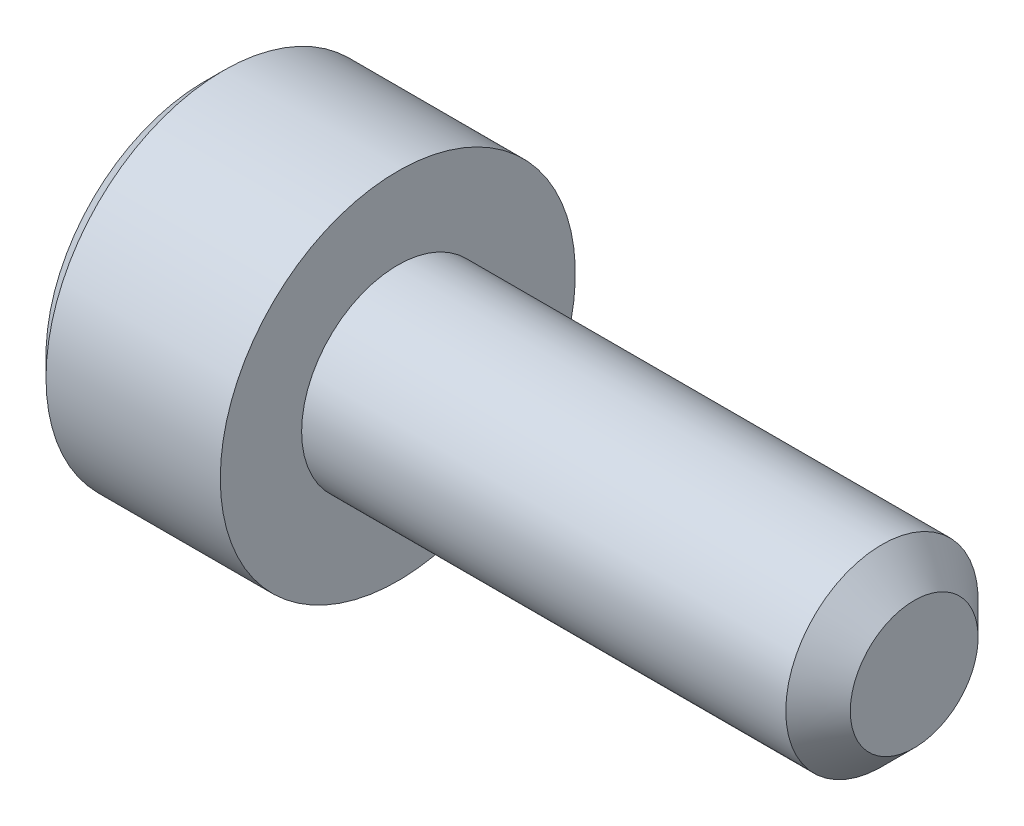
ISO-10303-21;
HEADER;
FILE_DESCRIPTION(('STEP AP214'),'2;1');
FILE_NAME('part.step','',(''),(''),'','','');
FILE_SCHEMA(('AUTOMOTIVE_DESIGN { 1 0 10303 214 1 1 1 1 }'));
ENDSEC;
DATA;
#1=APPLICATION_CONTEXT('core data for automotive mechanical design processes');
#2=APPLICATION_PROTOCOL_DEFINITION('international standard','automotive_design',2000,#1);
#3=PRODUCT_CONTEXT('',#1,'mechanical');
#4=PRODUCT('Part','Part','',(#3));
#5=PRODUCT_RELATED_PRODUCT_CATEGORY('part','',(#4));
#6=PRODUCT_DEFINITION_FORMATION('','',#4);
#7=PRODUCT_DEFINITION_CONTEXT('part definition',#1,'design');
#8=PRODUCT_DEFINITION('design','',#6,#7);
#9=PRODUCT_DEFINITION_SHAPE('','',#8);
#10=(LENGTH_UNIT() NAMED_UNIT(*) SI_UNIT(.MILLI.,.METRE.));
#11=(NAMED_UNIT(*) PLANE_ANGLE_UNIT() SI_UNIT($,.RADIAN.));
#12=(NAMED_UNIT(*) SI_UNIT($,.STERADIAN.) SOLID_ANGLE_UNIT());
#13=UNCERTAINTY_MEASURE_WITH_UNIT(LENGTH_MEASURE(1.E-05),#10,'distance_accuracy_value','');
#14=(GEOMETRIC_REPRESENTATION_CONTEXT(3) GLOBAL_UNCERTAINTY_ASSIGNED_CONTEXT((#13)) GLOBAL_UNIT_ASSIGNED_CONTEXT((#10,
#11,#12)) REPRESENTATION_CONTEXT('',''));
#15=CARTESIAN_POINT('',(0.,0.,0.));
#16=DIRECTION('',(0.,0.,1.));
#17=DIRECTION('',(1.,0.,0.));
#18=AXIS2_PLACEMENT_3D('',#15,#16,#17);
#19=CARTESIAN_POINT('',(0.,0.,0.));
#20=DIRECTION('',(1.,0.,0.));
#21=DIRECTION('',(0.,0.,-1.));
#22=AXIS2_PLACEMENT_3D('',#19,#20,#21);
#23=PLANE('',#22);
#24=DIRECTION('',(0.,0.866025403784439,0.5));
#25=VECTOR('',#24,1.);
#26=CARTESIAN_POINT('',(0.,1.4,-0.981495457622362));
#27=LINE('',#26,#25);
#28=CARTESIAN_POINT('',(0.,0.,-1.78978583448784));
#29=VERTEX_POINT('',#28);
#30=CARTESIAN_POINT('',(0.,1.55,-0.894892917243918));
#31=VERTEX_POINT('',#30);
#32=EDGE_CURVE('E158',#29,#31,#27,.T.);
#33=ORIENTED_EDGE('',*,*,#32,.T.);
#34=DIRECTION('',(0.,0.,1.));
#35=VECTOR('',#34,1.);
#36=CARTESIAN_POINT('',(0.,1.55,0.721687836487032));
#37=LINE('',#36,#35);
#38=CARTESIAN_POINT('',(0.,1.55,0.894892917243919));
#39=VERTEX_POINT('',#38);
#40=EDGE_CURVE('E168',#31,#39,#37,.T.);
#41=ORIENTED_EDGE('',*,*,#40,.T.);
#42=DIRECTION('',(0.,-0.866025403784439,0.5));
#43=VECTOR('',#42,1.);
#44=CARTESIAN_POINT('',(0.,0.15,1.7031832941094));
#45=LINE('',#44,#43);
#46=CARTESIAN_POINT('',(0.,0.,1.78978583448784));
#47=VERTEX_POINT('',#46);
#48=EDGE_CURVE('E166',#39,#47,#45,.T.);
#49=ORIENTED_EDGE('',*,*,#48,.T.);
#50=DIRECTION('',(0.,-0.866025403784439,-0.5));
#51=VECTOR('',#50,1.);
#52=CARTESIAN_POINT('',(0.,-1.4,0.981495457622364));
#53=LINE('',#52,#51);
#54=CARTESIAN_POINT('',(0.,-1.55,0.89489291724392));
#55=VERTEX_POINT('',#54);
#56=EDGE_CURVE('E164',#47,#55,#53,.T.);
#57=ORIENTED_EDGE('',*,*,#56,.T.);
#58=DIRECTION('',(0.,0.,-1.));
#59=VECTOR('',#58,1.);
#60=CARTESIAN_POINT('',(0.,-1.55,-0.721687836487031));
#61=LINE('',#60,#59);
#62=CARTESIAN_POINT('',(0.,-1.55,-0.894892917243919));
#63=VERTEX_POINT('',#62);
#64=EDGE_CURVE('E162',#55,#63,#61,.T.);
#65=ORIENTED_EDGE('',*,*,#64,.T.);
#66=DIRECTION('',(0.,0.866025403784439,-0.5));
#67=VECTOR('',#66,1.);
#68=CARTESIAN_POINT('',(0.,-0.149999999999999,-1.7031832941094));
#69=LINE('',#68,#67);
#70=EDGE_CURVE('E160',#63,#29,#69,.T.);
#71=ORIENTED_EDGE('',*,*,#70,.T.);
#72=EDGE_LOOP('',(#33,#41,#49,#57,#65,#71));
#73=FACE_BOUND('',#72,.T.);
#74=CARTESIAN_POINT('',(0.,0.,0.));
#75=DIRECTION('',(1.,0.,0.));
#76=DIRECTION('',(0.,0.,-1.));
#77=AXIS2_PLACEMENT_3D('',#74,#75,#76);
#78=CIRCLE('',#77,2.44999999999999);
#79=CARTESIAN_POINT('',(0.,0.,-2.44999999999999));
#80=VERTEX_POINT('',#79);
#81=EDGE_CURVE('E152',#80,#80,#78,.F.);
#82=ORIENTED_EDGE('',*,*,#81,.T.);
#83=EDGE_LOOP('',(#82));
#84=FACE_BOUND('',#83,.T.);
#85=ADVANCED_FACE('F37',(#73,#84),#23,.F.);
#86=CARTESIAN_POINT('',(11.,0.,0.));
#87=DIRECTION('',(-1.,0.,0.));
#88=DIRECTION('',(0.,0.,1.));
#89=AXIS2_PLACEMENT_3D('',#86,#87,#88);
#90=PLANE('',#89);
#91=CARTESIAN_POINT('',(11.,0.,0.));
#92=DIRECTION('',(-1.,0.,0.));
#93=DIRECTION('',(0.,0.,1.));
#94=AXIS2_PLACEMENT_3D('',#91,#92,#93);
#95=CIRCLE('',#94,0.989999999999991);
#96=CARTESIAN_POINT('',(11.,0.,0.989999999999991));
#97=VERTEX_POINT('',#96);
#98=EDGE_CURVE('E149',#97,#97,#95,.F.);
#99=ORIENTED_EDGE('',*,*,#98,.T.);
#100=EDGE_LOOP('',(#99));
#101=FACE_BOUND('',#100,.T.);
#102=ADVANCED_FACE('F248',(#101),#90,.F.);
#103=CARTESIAN_POINT('',(-88.7054908485857,0.,0.));
#104=DIRECTION('',(-1.,0.,0.));
#105=DIRECTION('',(0.,0.,1.));
#106=AXIS2_PLACEMENT_3D('',#103,#104,#105);
#107=CYLINDRICAL_SURFACE('',#106,1.49);
#108=CARTESIAN_POINT('',(10.5,0.,0.));
#109=DIRECTION('',(-1.,0.,0.));
#110=DIRECTION('',(0.,0.,1.));
#111=AXIS2_PLACEMENT_3D('',#108,#109,#110);
#112=CIRCLE('',#111,1.49);
#113=CARTESIAN_POINT('',(10.5,0.,1.49));
#114=VERTEX_POINT('',#113);
#115=EDGE_CURVE('E146',#114,#114,#112,.T.);
#116=ORIENTED_EDGE('',*,*,#115,.T.);
#117=EDGE_LOOP('',(#116));
#118=FACE_BOUND('',#117,.T.);
#119=CARTESIAN_POINT('',(3.,0.,0.));
#120=DIRECTION('',(-1.,0.,0.));
#121=DIRECTION('',(0.,0.,1.));
#122=AXIS2_PLACEMENT_3D('',#119,#120,#121);
#123=CIRCLE('',#122,1.49);
#124=CARTESIAN_POINT('',(3.,0.,1.49));
#125=VERTEX_POINT('',#124);
#126=EDGE_CURVE('E138',#125,#125,#123,.T.);
#127=ORIENTED_EDGE('',*,*,#126,.F.);
#128=EDGE_LOOP('',(#127));
#129=FACE_BOUND('',#128,.T.);
#130=ADVANCED_FACE('F253',(#118,#129),#107,.T.);
#131=CARTESIAN_POINT('',(3.,1.49,0.));
#132=DIRECTION('',(-1.,0.,0.));
#133=DIRECTION('',(0.,0.,1.));
#134=AXIS2_PLACEMENT_3D('',#131,#132,#133);
#135=PLANE('',#134);
#136=CARTESIAN_POINT('',(3.,0.,0.));
#137=DIRECTION('',(-1.,0.,0.));
#138=DIRECTION('',(0.,0.,1.));
#139=AXIS2_PLACEMENT_3D('',#136,#137,#138);
#140=CIRCLE('',#139,2.75);
#141=CARTESIAN_POINT('',(3.,0.,2.75));
#142=VERTEX_POINT('',#141);
#143=EDGE_CURVE('E134',#142,#142,#140,.T.);
#144=ORIENTED_EDGE('',*,*,#143,.F.);
#145=EDGE_LOOP('',(#144));
#146=FACE_BOUND('',#145,.T.);
#147=ORIENTED_EDGE('',*,*,#126,.T.);
#148=EDGE_LOOP('',(#147));
#149=FACE_BOUND('',#148,.T.);
#150=ADVANCED_FACE('F263',(#146,#149),#135,.F.);
#151=CARTESIAN_POINT('',(-88.7054908485857,0.,0.));
#152=DIRECTION('',(-1.,0.,0.));
#153=DIRECTION('',(0.,0.,1.));
#154=AXIS2_PLACEMENT_3D('',#151,#152,#153);
#155=CYLINDRICAL_SURFACE('',#154,2.75);
#156=CARTESIAN_POINT('',(0.300000000000009,0.,0.));
#157=DIRECTION('',(1.,0.,0.));
#158=DIRECTION('',(0.,0.,-1.));
#159=AXIS2_PLACEMENT_3D('',#156,#157,#158);
#160=CIRCLE('',#159,2.75);
#161=CARTESIAN_POINT('',(0.300000000000009,0.,-2.75));
#162=VERTEX_POINT('',#161);
#163=EDGE_CURVE('E155',#162,#162,#160,.T.);
#164=ORIENTED_EDGE('',*,*,#163,.T.);
#165=EDGE_LOOP('',(#164));
#166=FACE_BOUND('',#165,.T.);
#167=ORIENTED_EDGE('',*,*,#143,.T.);
#168=EDGE_LOOP('',(#167));
#169=FACE_BOUND('',#168,.T.);
#170=ADVANCED_FACE('F259',(#166,#169),#155,.T.);
#171=CARTESIAN_POINT('',(10.5,0.,0.));
#172=DIRECTION('',(-1.,0.,0.));
#173=DIRECTION('',(0.,0.,1.));
#174=AXIS2_PLACEMENT_3D('',#171,#172,#173);
#175=CONICAL_SURFACE('',#174,1.49,0.785398163397451);
#176=ORIENTED_EDGE('',*,*,#98,.F.);
#177=EDGE_LOOP('',(#176));
#178=FACE_BOUND('',#177,.T.);
#179=ORIENTED_EDGE('',*,*,#115,.F.);
#180=EDGE_LOOP('',(#179));
#181=FACE_BOUND('',#180,.T.);
#182=ADVANCED_FACE('F262',(#178,#181),#175,.T.);
#183=CARTESIAN_POINT('',(0.,0.,0.));
#184=DIRECTION('',(1.,0.,0.));
#185=DIRECTION('',(0.,0.,-1.));
#186=AXIS2_PLACEMENT_3D('',#183,#184,#185);
#187=CONICAL_SURFACE('',#186,2.44999999999999,0.785398163397444);
#188=ORIENTED_EDGE('',*,*,#163,.F.);
#189=EDGE_LOOP('',(#188));
#190=FACE_BOUND('',#189,.T.);
#191=ORIENTED_EDGE('',*,*,#81,.F.);
#192=EDGE_LOOP('',(#191));
#193=FACE_BOUND('',#192,.T.);
#194=ADVANCED_FACE('F273',(#190,#193),#187,.T.);
#195=CARTESIAN_POINT('',(2.5,1.25,0.721687836487032));
#196=DIRECTION('',(0.,-0.5,-0.866025403784438));
#197=DIRECTION('',(0.,0.866025403784439,-0.5));
#198=AXIS2_PLACEMENT_3D('',#195,#196,#197);
#199=PLANE('',#198);
#200=DIRECTION('',(-1.,0.,0.));
#201=VECTOR('',#200,1.);
#202=CARTESIAN_POINT('',(2.5,0.,1.44337567297407));
#203=LINE('',#202,#201);
#204=CARTESIAN_POINT('',(2.5,0.,1.44337567297407));
#205=VERTEX_POINT('',#204);
#206=CARTESIAN_POINT('',(0.3,0.,1.44337567297407));
#207=VERTEX_POINT('',#206);
#208=EDGE_CURVE('E126',#205,#207,#203,.T.);
#209=ORIENTED_EDGE('',*,*,#208,.T.);
#210=DIRECTION('',(0.,0.866025403784439,-0.5));
#211=VECTOR('',#210,1.);
#212=CARTESIAN_POINT('',(0.3,1.25,0.721687836487032));
#213=LINE('',#212,#211);
#214=CARTESIAN_POINT('',(0.3,1.25,0.721687836487032));
#215=VERTEX_POINT('',#214);
#216=EDGE_CURVE('E174',#207,#215,#213,.T.);
#217=ORIENTED_EDGE('',*,*,#216,.T.);
#218=DIRECTION('',(-1.,0.,0.));
#219=VECTOR('',#218,1.);
#220=CARTESIAN_POINT('',(2.5,1.25,0.721687836487032));
#221=LINE('',#220,#219);
#222=CARTESIAN_POINT('',(2.5,1.25,0.721687836487032));
#223=VERTEX_POINT('',#222);
#224=EDGE_CURVE('E129',#223,#215,#221,.T.);
#225=ORIENTED_EDGE('',*,*,#224,.F.);
#226=DIRECTION('',(0.,-0.866025403784439,0.5));
#227=VECTOR('',#226,1.);
#228=CARTESIAN_POINT('',(2.5,1.25,0.721687836487032));
#229=LINE('',#228,#227);
#230=EDGE_CURVE('E114',#223,#205,#229,.T.);
#231=ORIENTED_EDGE('',*,*,#230,.T.);
#232=EDGE_LOOP('',(#209,#217,#225,#231));
#233=FACE_BOUND('',#232,.T.);
#234=ADVANCED_FACE('F125',(#233),#199,.T.);
#235=CARTESIAN_POINT('',(2.5,0.,1.44337567297407));
#236=DIRECTION('',(0.,0.5,-0.866025403784438));
#237=DIRECTION('',(0.,0.866025403784439,0.5));
#238=AXIS2_PLACEMENT_3D('',#235,#236,#237);
#239=PLANE('',#238);
#240=DIRECTION('',(-1.,0.,0.));
#241=VECTOR('',#240,1.);
#242=CARTESIAN_POINT('',(2.5,-1.25,0.721687836487033));
#243=LINE('',#242,#241);
#244=CARTESIAN_POINT('',(2.5,-1.25,0.721687836487033));
#245=VERTEX_POINT('',#244);
#246=CARTESIAN_POINT('',(0.3,-1.25,0.721687836487033));
#247=VERTEX_POINT('',#246);
#248=EDGE_CURVE('E135',#245,#247,#243,.T.);
#249=ORIENTED_EDGE('',*,*,#248,.T.);
#250=DIRECTION('',(0.,0.866025403784439,0.5));
#251=VECTOR('',#250,1.);
#252=CARTESIAN_POINT('',(0.3,0.,1.44337567297407));
#253=LINE('',#252,#251);
#254=EDGE_CURVE('E133',#247,#207,#253,.T.);
#255=ORIENTED_EDGE('',*,*,#254,.T.);
#256=ORIENTED_EDGE('',*,*,#208,.F.);
#257=DIRECTION('',(0.,-0.866025403784439,-0.5));
#258=VECTOR('',#257,1.);
#259=CARTESIAN_POINT('',(2.5,0.,1.44337567297407));
#260=LINE('',#259,#258);
#261=EDGE_CURVE('E110',#205,#245,#260,.T.);
#262=ORIENTED_EDGE('',*,*,#261,.T.);
#263=EDGE_LOOP('',(#249,#255,#256,#262));
#264=FACE_BOUND('',#263,.T.);
#265=ADVANCED_FACE('F131',(#264),#239,.T.);
#266=CARTESIAN_POINT('',(2.5,-1.25,0.721687836487033));
#267=DIRECTION('',(0.,1.,0.));
#268=DIRECTION('',(0.,0.,1.));
#269=AXIS2_PLACEMENT_3D('',#266,#267,#268);
#270=PLANE('',#269);
#271=DIRECTION('',(-1.,0.,0.));
#272=VECTOR('',#271,1.);
#273=CARTESIAN_POINT('',(2.5,-1.25,-0.721687836487031));
#274=LINE('',#273,#272);
#275=CARTESIAN_POINT('',(2.5,-1.25,-0.721687836487031));
#276=VERTEX_POINT('',#275);
#277=CARTESIAN_POINT('',(0.3,-1.25,-0.721687836487031));
#278=VERTEX_POINT('',#277);
#279=EDGE_CURVE('E140',#276,#278,#274,.T.);
#280=ORIENTED_EDGE('',*,*,#279,.T.);
#281=DIRECTION('',(0.,0.,1.));
#282=VECTOR('',#281,1.);
#283=CARTESIAN_POINT('',(0.3,-1.25,0.721687836487033));
#284=LINE('',#283,#282);
#285=EDGE_CURVE('E177',#278,#247,#284,.T.);
#286=ORIENTED_EDGE('',*,*,#285,.T.);
#287=ORIENTED_EDGE('',*,*,#248,.F.);
#288=DIRECTION('',(0.,0.,-1.));
#289=VECTOR('',#288,1.);
#290=CARTESIAN_POINT('',(2.5,-1.25,0.721687836487033));
#291=LINE('',#290,#289);
#292=EDGE_CURVE('E116',#245,#276,#291,.T.);
#293=ORIENTED_EDGE('',*,*,#292,.T.);
#294=EDGE_LOOP('',(#280,#286,#287,#293));
#295=FACE_BOUND('',#294,.T.);
#296=ADVANCED_FACE('F204',(#295),#270,.T.);
#297=CARTESIAN_POINT('',(2.5,-1.25,-0.721687836487031));
#298=DIRECTION('',(0.,0.5,0.866025403784439));
#299=DIRECTION('',(0.,-0.866025403784439,0.5));
#300=AXIS2_PLACEMENT_3D('',#297,#298,#299);
#301=PLANE('',#300);
#302=DIRECTION('',(-1.,0.,0.));
#303=VECTOR('',#302,1.);
#304=CARTESIAN_POINT('',(2.5,0.,-1.44337567297406));
#305=LINE('',#304,#303);
#306=CARTESIAN_POINT('',(2.5,0.,-1.44337567297406));
#307=VERTEX_POINT('',#306);
#308=CARTESIAN_POINT('',(0.3,0.,-1.44337567297406));
#309=VERTEX_POINT('',#308);
#310=EDGE_CURVE('E205',#307,#309,#305,.T.);
#311=ORIENTED_EDGE('',*,*,#310,.T.);
#312=DIRECTION('',(0.,-0.866025403784439,0.5));
#313=VECTOR('',#312,1.);
#314=CARTESIAN_POINT('',(0.3,-1.25,-0.721687836487031));
#315=LINE('',#314,#313);
#316=EDGE_CURVE('E46',#309,#278,#315,.T.);
#317=ORIENTED_EDGE('',*,*,#316,.T.);
#318=ORIENTED_EDGE('',*,*,#279,.F.);
#319=DIRECTION('',(0.,0.866025403784439,-0.499999999999999));
#320=VECTOR('',#319,1.);
#321=CARTESIAN_POINT('',(2.5,-1.25,-0.721687836487031));
#322=LINE('',#321,#320);
#323=EDGE_CURVE('E215',#276,#307,#322,.T.);
#324=ORIENTED_EDGE('',*,*,#323,.T.);
#325=EDGE_LOOP('',(#311,#317,#318,#324));
#326=FACE_BOUND('',#325,.T.);
#327=ADVANCED_FACE('F217',(#326),#301,.T.);
#328=CARTESIAN_POINT('',(2.5,0.,-1.44337567297406));
#329=DIRECTION('',(0.,-0.5,0.866025403784439));
#330=DIRECTION('',(0.,-0.866025403784439,-0.5));
#331=AXIS2_PLACEMENT_3D('',#328,#329,#330);
#332=PLANE('',#331);
#333=DIRECTION('',(-1.,0.,0.));
#334=VECTOR('',#333,1.);
#335=CARTESIAN_POINT('',(2.5,1.25,-0.72168783648703));
#336=LINE('',#335,#334);
#337=CARTESIAN_POINT('',(2.5,1.25,-0.72168783648703));
#338=VERTEX_POINT('',#337);
#339=CARTESIAN_POINT('',(0.3,1.25,-0.72168783648703));
#340=VERTEX_POINT('',#339);
#341=EDGE_CURVE('E206',#338,#340,#336,.T.);
#342=ORIENTED_EDGE('',*,*,#341,.T.);
#343=DIRECTION('',(0.,-0.866025403784439,-0.5));
#344=VECTOR('',#343,1.);
#345=CARTESIAN_POINT('',(0.3,0.,-1.44337567297406));
#346=LINE('',#345,#344);
#347=EDGE_CURVE('E11',#340,#309,#346,.T.);
#348=ORIENTED_EDGE('',*,*,#347,.T.);
#349=ORIENTED_EDGE('',*,*,#310,.F.);
#350=DIRECTION('',(0.,0.866025403784438,0.5));
#351=VECTOR('',#350,1.);
#352=CARTESIAN_POINT('',(2.5,0.,-1.44337567297406));
#353=LINE('',#352,#351);
#354=EDGE_CURVE('E213',#307,#338,#353,.T.);
#355=ORIENTED_EDGE('',*,*,#354,.T.);
#356=EDGE_LOOP('',(#342,#348,#349,#355));
#357=FACE_BOUND('',#356,.T.);
#358=ADVANCED_FACE('F219',(#357),#332,.T.);
#359=CARTESIAN_POINT('',(2.5,1.25,-0.72168783648703));
#360=DIRECTION('',(0.,-1.,0.));
#361=DIRECTION('',(0.,0.,-1.));
#362=AXIS2_PLACEMENT_3D('',#359,#360,#361);
#363=PLANE('',#362);
#364=ORIENTED_EDGE('',*,*,#224,.T.);
#365=DIRECTION('',(0.,0.,-1.));
#366=VECTOR('',#365,1.);
#367=CARTESIAN_POINT('',(0.3,1.25,-0.72168783648703));
#368=LINE('',#367,#366);
#369=EDGE_CURVE('E171',#215,#340,#368,.T.);
#370=ORIENTED_EDGE('',*,*,#369,.T.);
#371=ORIENTED_EDGE('',*,*,#341,.F.);
#372=DIRECTION('',(0.,0.,1.));
#373=VECTOR('',#372,1.);
#374=CARTESIAN_POINT('',(2.5,1.25,-0.72168783648703));
#375=LINE('',#374,#373);
#376=EDGE_CURVE('E211',#338,#223,#375,.T.);
#377=ORIENTED_EDGE('',*,*,#376,.T.);
#378=EDGE_LOOP('',(#364,#370,#371,#377));
#379=FACE_BOUND('',#378,.T.);
#380=ADVANCED_FACE('F222',(#379),#363,.T.);
#381=CARTESIAN_POINT('',(2.5,0.,0.));
#382=DIRECTION('',(1.,0.,0.));
#383=DIRECTION('',(0.,0.,-1.));
#384=AXIS2_PLACEMENT_3D('',#381,#382,#383);
#385=PLANE('',#384);
#386=ORIENTED_EDGE('',*,*,#230,.F.);
#387=ORIENTED_EDGE('',*,*,#376,.F.);
#388=ORIENTED_EDGE('',*,*,#354,.F.);
#389=ORIENTED_EDGE('',*,*,#323,.F.);
#390=ORIENTED_EDGE('',*,*,#292,.F.);
#391=ORIENTED_EDGE('',*,*,#261,.F.);
#392=EDGE_LOOP('',(#386,#387,#388,#389,#390,#391));
#393=FACE_BOUND('',#392,.T.);
#394=ADVANCED_FACE('F112',(#393),#385,.F.);
#395=CARTESIAN_POINT('',(0.,-1.55,0.));
#396=DIRECTION('',(-0.707106781186547,0.707106781186547,0.));
#397=DIRECTION('',(0.,0.,1.));
#398=AXIS2_PLACEMENT_3D('',#395,#396,#397);
#399=PLANE('',#398);
#400=DIRECTION('',(0.654653670707977,0.654653670707977,-0.377964473009227));
#401=VECTOR('',#400,1.);
#402=CARTESIAN_POINT('',(0.221428571428572,-1.32857142857143,0.76705107192336));
#403=LINE('',#402,#401);
#404=EDGE_CURVE('E189',#247,#55,#403,.F.);
#405=ORIENTED_EDGE('',*,*,#404,.F.);
#406=ORIENTED_EDGE('',*,*,#285,.F.);
#407=DIRECTION('',(0.654653670707977,0.654653670707977,0.377964473009227));
#408=VECTOR('',#407,1.);
#409=CARTESIAN_POINT('',(0.221428571428571,-1.32857142857143,-0.767051071923359));
#410=LINE('',#409,#408);
#411=EDGE_CURVE('E41',#63,#278,#410,.T.);
#412=ORIENTED_EDGE('',*,*,#411,.F.);
#413=ORIENTED_EDGE('',*,*,#64,.F.);
#414=EDGE_LOOP('',(#405,#406,#412,#413));
#415=FACE_BOUND('',#414,.T.);
#416=ADVANCED_FACE('F39',(#415),#399,.T.);
#417=CARTESIAN_POINT('',(0.,-0.774999999999999,-1.34233937586588));
#418=DIRECTION('',(-0.707106781186547,0.353553390593273,0.612372435695795));
#419=DIRECTION('',(0.,-0.866025403784439,0.5));
#420=AXIS2_PLACEMENT_3D('',#417,#418,#419);
#421=PLANE('',#420);
#422=ORIENTED_EDGE('',*,*,#411,.T.);
#423=ORIENTED_EDGE('',*,*,#316,.F.);
#424=DIRECTION('',(0.654653670707977,0.,0.755928946018454));
#425=VECTOR('',#424,1.);
#426=CARTESIAN_POINT('',(0.221428571428571,0.,-1.53410214384672));
#427=LINE('',#426,#425);
#428=EDGE_CURVE('E187',#29,#309,#427,.T.);
#429=ORIENTED_EDGE('',*,*,#428,.F.);
#430=ORIENTED_EDGE('',*,*,#70,.F.);
#431=EDGE_LOOP('',(#422,#423,#429,#430));
#432=FACE_BOUND('',#431,.T.);
#433=ADVANCED_FACE('F198',(#432),#421,.T.);
#434=CARTESIAN_POINT('',(0.,-0.775000000000001,1.34233937586588));
#435=DIRECTION('',(-0.707106781186547,0.353553390593274,-0.612372435695795));
#436=DIRECTION('',(0.,0.866025403784439,0.5));
#437=AXIS2_PLACEMENT_3D('',#434,#435,#436);
#438=PLANE('',#437);
#439=ORIENTED_EDGE('',*,*,#404,.T.);
#440=ORIENTED_EDGE('',*,*,#56,.F.);
#441=DIRECTION('',(0.654653670707977,0.,-0.755928946018454));
#442=VECTOR('',#441,1.);
#443=CARTESIAN_POINT('',(0.221428571428572,0.,1.53410214384672));
#444=LINE('',#443,#442);
#445=EDGE_CURVE('E184',#207,#47,#444,.F.);
#446=ORIENTED_EDGE('',*,*,#445,.F.);
#447=ORIENTED_EDGE('',*,*,#254,.F.);
#448=EDGE_LOOP('',(#439,#440,#446,#447));
#449=FACE_BOUND('',#448,.T.);
#450=ADVANCED_FACE('F239',(#449),#438,.T.);
#451=CARTESIAN_POINT('',(0.,0.775,-1.34233937586588));
#452=DIRECTION('',(-0.707106781186548,-0.353553390593274,0.612372435695794));
#453=DIRECTION('',(0.,-0.866025403784439,-0.5));
#454=AXIS2_PLACEMENT_3D('',#451,#452,#453);
#455=PLANE('',#454);
#456=ORIENTED_EDGE('',*,*,#428,.T.);
#457=ORIENTED_EDGE('',*,*,#347,.F.);
#458=DIRECTION('',(-0.654653670707977,0.654653670707977,-0.377964473009227));
#459=VECTOR('',#458,1.);
#460=CARTESIAN_POINT('',(0.221428571428571,1.32857142857143,-0.767051071923358));
#461=LINE('',#460,#459);
#462=EDGE_CURVE('E182',#31,#340,#461,.F.);
#463=ORIENTED_EDGE('',*,*,#462,.F.);
#464=ORIENTED_EDGE('',*,*,#32,.F.);
#465=EDGE_LOOP('',(#456,#457,#463,#464));
#466=FACE_BOUND('',#465,.T.);
#467=ADVANCED_FACE('F237',(#466),#455,.T.);
#468=CARTESIAN_POINT('',(0.,0.775,1.34233937586588));
#469=DIRECTION('',(-0.707106781186547,-0.353553390593274,-0.612372435695795));
#470=DIRECTION('',(0.,0.866025403784439,-0.5));
#471=AXIS2_PLACEMENT_3D('',#468,#469,#470);
#472=PLANE('',#471);
#473=ORIENTED_EDGE('',*,*,#445,.T.);
#474=ORIENTED_EDGE('',*,*,#48,.F.);
#475=DIRECTION('',(0.654653670707977,-0.654653670707977,-0.377964473009227));
#476=VECTOR('',#475,1.);
#477=CARTESIAN_POINT('',(0.221428571428571,1.32857142857143,0.76705107192336));
#478=LINE('',#477,#476);
#479=EDGE_CURVE('E180',#215,#39,#478,.F.);
#480=ORIENTED_EDGE('',*,*,#479,.F.);
#481=ORIENTED_EDGE('',*,*,#216,.F.);
#482=EDGE_LOOP('',(#473,#474,#480,#481));
#483=FACE_BOUND('',#482,.T.);
#484=ADVANCED_FACE('F232',(#483),#472,.T.);
#485=CARTESIAN_POINT('',(0.,1.55,0.));
#486=DIRECTION('',(-0.707106781186547,-0.707106781186547,0.));
#487=DIRECTION('',(0.,0.,-1.));
#488=AXIS2_PLACEMENT_3D('',#485,#486,#487);
#489=PLANE('',#488);
#490=ORIENTED_EDGE('',*,*,#462,.T.);
#491=ORIENTED_EDGE('',*,*,#369,.F.);
#492=ORIENTED_EDGE('',*,*,#479,.T.);
#493=ORIENTED_EDGE('',*,*,#40,.F.);
#494=EDGE_LOOP('',(#490,#491,#492,#493));
#495=FACE_BOUND('',#494,.T.);
#496=ADVANCED_FACE('F226',(#495),#489,.T.);
#497=CLOSED_SHELL('',(#85,#102,#130,#150,#170,#182,#194,#234,#265,#296,#327,#358,#380,#394,#416,
#433,#450,#467,#484,#496));
#498=MANIFOLD_SOLID_BREP('B2',#497);
#499=ADVANCED_BREP_SHAPE_REPRESENTATION('',(#18,#498),#14);
#500=SHAPE_DEFINITION_REPRESENTATION(#9,#499);
ENDSEC;
END-ISO-10303-21;
